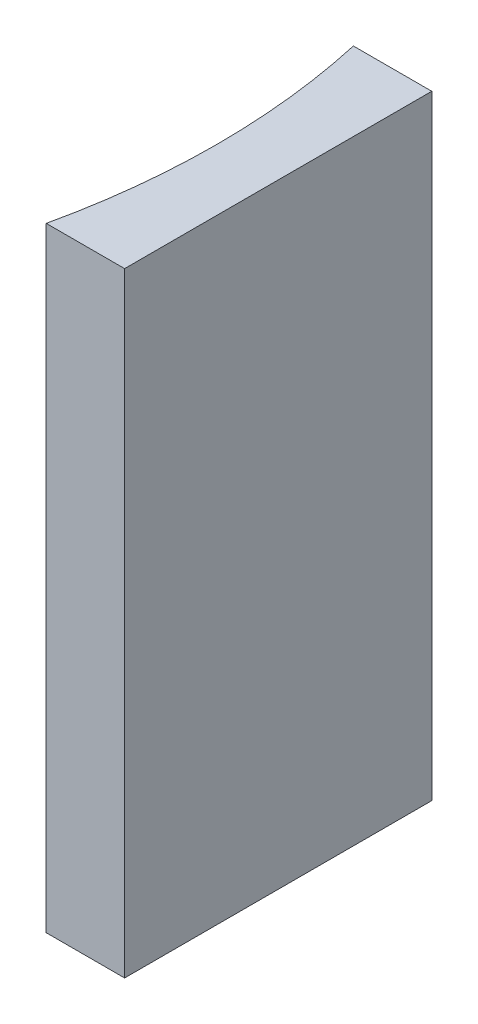
ISO-10303-21;
HEADER;
FILE_DESCRIPTION(('STEP AP214'),'2;1');
FILE_NAME('part.step','',(''),(''),'','','');
FILE_SCHEMA(('AUTOMOTIVE_DESIGN { 1 0 10303 214 1 1 1 1 }'));
ENDSEC;
DATA;
#1=APPLICATION_CONTEXT('core data for automotive mechanical design processes');
#2=APPLICATION_PROTOCOL_DEFINITION('international standard','automotive_design',2000,#1);
#3=PRODUCT_CONTEXT('',#1,'mechanical');
#4=PRODUCT('Part','Part','',(#3));
#5=PRODUCT_RELATED_PRODUCT_CATEGORY('part','',(#4));
#6=PRODUCT_DEFINITION_FORMATION('','',#4);
#7=PRODUCT_DEFINITION_CONTEXT('part definition',#1,'design');
#8=PRODUCT_DEFINITION('design','',#6,#7);
#9=PRODUCT_DEFINITION_SHAPE('','',#8);
#10=(LENGTH_UNIT() NAMED_UNIT(*) SI_UNIT(.MILLI.,.METRE.));
#11=(NAMED_UNIT(*) PLANE_ANGLE_UNIT() SI_UNIT($,.RADIAN.));
#12=(NAMED_UNIT(*) SI_UNIT($,.STERADIAN.) SOLID_ANGLE_UNIT());
#13=UNCERTAINTY_MEASURE_WITH_UNIT(LENGTH_MEASURE(1.E-05),#10,'distance_accuracy_value','');
#14=(GEOMETRIC_REPRESENTATION_CONTEXT(3) GLOBAL_UNCERTAINTY_ASSIGNED_CONTEXT((#13)) GLOBAL_UNIT_ASSIGNED_CONTEXT((#10,
#11,#12)) REPRESENTATION_CONTEXT('',''));
#15=CARTESIAN_POINT('',(0.,0.,0.));
#16=DIRECTION('',(0.,0.,1.));
#17=DIRECTION('',(1.,0.,0.));
#18=AXIS2_PLACEMENT_3D('',#15,#16,#17);
#19=CARTESIAN_POINT('',(0.,20.,0.));
#20=DIRECTION('',(0.,0.,1.));
#21=DIRECTION('',(1.,0.,0.));
#22=AXIS2_PLACEMENT_3D('',#19,#20,#21);
#23=PLANE('',#22);
#24=DIRECTION('',(-1.,0.,0.));
#25=VECTOR('',#24,1.);
#26=CARTESIAN_POINT('',(0.,0.,0.));
#27=LINE('',#26,#25);
#28=CARTESIAN_POINT('',(0.,0.,0.));
#29=VERTEX_POINT('',#28);
#30=CARTESIAN_POINT('',(-2.55202288985434,0.,0.));
#31=VERTEX_POINT('',#30);
#32=EDGE_CURVE('E98',#29,#31,#27,.T.);
#33=ORIENTED_EDGE('',*,*,#32,.T.);
#34=DIRECTION('',(0.,-1.,0.));
#35=VECTOR('',#34,1.);
#36=CARTESIAN_POINT('',(-2.55202288985434,20.,0.));
#37=LINE('',#36,#35);
#38=CARTESIAN_POINT('',(-2.55202288985434,20.,0.));
#39=VERTEX_POINT('',#38);
#40=EDGE_CURVE('E11',#39,#31,#37,.T.);
#41=ORIENTED_EDGE('',*,*,#40,.F.);
#42=DIRECTION('',(-1.,0.,0.));
#43=VECTOR('',#42,1.);
#44=CARTESIAN_POINT('',(0.,20.,0.));
#45=LINE('',#44,#43);
#46=CARTESIAN_POINT('',(0.,20.,0.));
#47=VERTEX_POINT('',#46);
#48=EDGE_CURVE('E86',#47,#39,#45,.T.);
#49=ORIENTED_EDGE('',*,*,#48,.F.);
#50=DIRECTION('',(0.,-1.,0.));
#51=VECTOR('',#50,1.);
#52=CARTESIAN_POINT('',(0.,20.,0.));
#53=LINE('',#52,#51);
#54=EDGE_CURVE('E94',#47,#29,#53,.T.);
#55=ORIENTED_EDGE('',*,*,#54,.T.);
#56=EDGE_LOOP('',(#33,#41,#49,#55));
#57=FACE_BOUND('',#56,.T.);
#58=ADVANCED_FACE('F35',(#57),#23,.F.);
#59=CARTESIAN_POINT('',(-24.92,20.,5.));
#60=DIRECTION('',(0.,-1.,0.));
#61=DIRECTION('',(0.,0.,-1.));
#62=AXIS2_PLACEMENT_3D('',#59,#60,#61);
#63=CYLINDRICAL_SURFACE('',#62,22.92);
#64=CARTESIAN_POINT('',(-24.92,0.,5.));
#65=DIRECTION('',(0.,-1.,0.));
#66=DIRECTION('',(0.,0.,1.));
#67=AXIS2_PLACEMENT_3D('',#64,#65,#66);
#68=CIRCLE('',#67,22.92);
#69=CARTESIAN_POINT('',(-2.55202288985434,0.,10.));
#70=VERTEX_POINT('',#69);
#71=EDGE_CURVE('E90',#31,#70,#68,.T.);
#72=ORIENTED_EDGE('',*,*,#71,.T.);
#73=DIRECTION('',(0.,-1.,0.));
#74=VECTOR('',#73,1.);
#75=CARTESIAN_POINT('',(-2.55202288985434,20.,10.));
#76=LINE('',#75,#74);
#77=CARTESIAN_POINT('',(-2.55202288985434,20.,10.));
#78=VERTEX_POINT('',#77);
#79=EDGE_CURVE('E43',#78,#70,#76,.T.);
#80=ORIENTED_EDGE('',*,*,#79,.F.);
#81=CARTESIAN_POINT('',(-24.92,20.,5.));
#82=DIRECTION('',(0.,-1.,0.));
#83=DIRECTION('',(0.,0.,1.));
#84=AXIS2_PLACEMENT_3D('',#81,#82,#83);
#85=CIRCLE('',#84,22.92);
#86=EDGE_CURVE('E81',#39,#78,#85,.T.);
#87=ORIENTED_EDGE('',*,*,#86,.F.);
#88=ORIENTED_EDGE('',*,*,#40,.T.);
#89=EDGE_LOOP('',(#72,#80,#87,#88));
#90=FACE_BOUND('',#89,.T.);
#91=ADVANCED_FACE('F89',(#90),#63,.F.);
#92=CARTESIAN_POINT('',(0.,20.,10.));
#93=DIRECTION('',(0.,0.,-1.));
#94=DIRECTION('',(-1.,0.,0.));
#95=AXIS2_PLACEMENT_3D('',#92,#93,#94);
#96=PLANE('',#95);
#97=DIRECTION('',(1.,0.,0.));
#98=VECTOR('',#97,1.);
#99=CARTESIAN_POINT('',(0.,0.,10.));
#100=LINE('',#99,#98);
#101=CARTESIAN_POINT('',(0.,0.,10.));
#102=VERTEX_POINT('',#101);
#103=EDGE_CURVE('E68',#70,#102,#100,.T.);
#104=ORIENTED_EDGE('',*,*,#103,.T.);
#105=DIRECTION('',(0.,-1.,0.));
#106=VECTOR('',#105,1.);
#107=CARTESIAN_POINT('',(0.,20.,10.));
#108=LINE('',#107,#106);
#109=CARTESIAN_POINT('',(0.,20.,10.));
#110=VERTEX_POINT('',#109);
#111=EDGE_CURVE('E91',#110,#102,#108,.T.);
#112=ORIENTED_EDGE('',*,*,#111,.F.);
#113=DIRECTION('',(1.,0.,0.));
#114=VECTOR('',#113,1.);
#115=CARTESIAN_POINT('',(0.,20.,10.));
#116=LINE('',#115,#114);
#117=EDGE_CURVE('E84',#78,#110,#116,.T.);
#118=ORIENTED_EDGE('',*,*,#117,.F.);
#119=ORIENTED_EDGE('',*,*,#79,.T.);
#120=EDGE_LOOP('',(#104,#112,#118,#119));
#121=FACE_BOUND('',#120,.T.);
#122=ADVANCED_FACE('F92',(#121),#96,.F.);
#123=CARTESIAN_POINT('',(0.,20.,0.));
#124=DIRECTION('',(-1.,0.,0.));
#125=DIRECTION('',(0.,0.,1.));
#126=AXIS2_PLACEMENT_3D('',#123,#124,#125);
#127=PLANE('',#126);
#128=DIRECTION('',(0.,0.,-1.));
#129=VECTOR('',#128,1.);
#130=CARTESIAN_POINT('',(0.,0.,0.));
#131=LINE('',#130,#129);
#132=EDGE_CURVE('E74',#102,#29,#131,.T.);
#133=ORIENTED_EDGE('',*,*,#132,.T.);
#134=ORIENTED_EDGE('',*,*,#54,.F.);
#135=DIRECTION('',(0.,0.,-1.));
#136=VECTOR('',#135,1.);
#137=CARTESIAN_POINT('',(0.,20.,0.));
#138=LINE('',#137,#136);
#139=EDGE_CURVE('E51',#110,#47,#138,.T.);
#140=ORIENTED_EDGE('',*,*,#139,.F.);
#141=ORIENTED_EDGE('',*,*,#111,.T.);
#142=EDGE_LOOP('',(#133,#134,#140,#141));
#143=FACE_BOUND('',#142,.T.);
#144=ADVANCED_FACE('F105',(#143),#127,.F.);
#145=CARTESIAN_POINT('',(-24.92,20.,5.));
#146=DIRECTION('',(0.,1.,0.));
#147=DIRECTION('',(0.,0.,1.));
#148=AXIS2_PLACEMENT_3D('',#145,#146,#147);
#149=PLANE('',#148);
#150=ORIENTED_EDGE('',*,*,#48,.T.);
#151=ORIENTED_EDGE('',*,*,#86,.T.);
#152=ORIENTED_EDGE('',*,*,#117,.T.);
#153=ORIENTED_EDGE('',*,*,#139,.T.);
#154=EDGE_LOOP('',(#150,#151,#152,#153));
#155=FACE_BOUND('',#154,.T.);
#156=ADVANCED_FACE('F82',(#155),#149,.T.);
#157=CARTESIAN_POINT('',(-24.92,0.,5.));
#158=DIRECTION('',(0.,1.,0.));
#159=DIRECTION('',(0.,0.,1.));
#160=AXIS2_PLACEMENT_3D('',#157,#158,#159);
#161=PLANE('',#160);
#162=ORIENTED_EDGE('',*,*,#32,.F.);
#163=ORIENTED_EDGE('',*,*,#132,.F.);
#164=ORIENTED_EDGE('',*,*,#103,.F.);
#165=ORIENTED_EDGE('',*,*,#71,.F.);
#166=EDGE_LOOP('',(#162,#163,#164,#165));
#167=FACE_BOUND('',#166,.T.);
#168=ADVANCED_FACE('F108',(#167),#161,.F.);
#169=CLOSED_SHELL('',(#58,#91,#122,#144,#156,#168));
#170=MANIFOLD_SOLID_BREP('B2',#169);
#171=ADVANCED_BREP_SHAPE_REPRESENTATION('',(#18,#170),#14);
#172=SHAPE_DEFINITION_REPRESENTATION(#9,#171);
ENDSEC;
END-ISO-10303-21;
